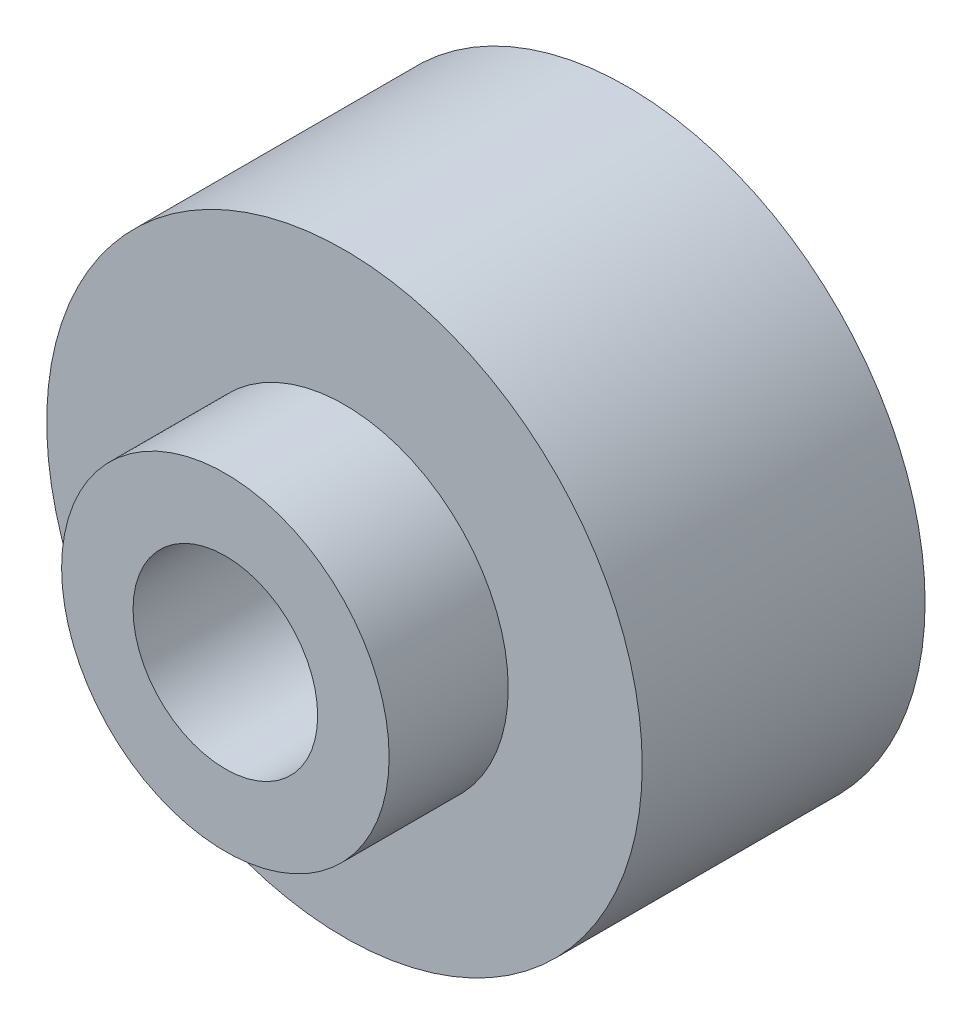
ISO-10303-21;
HEADER;
FILE_DESCRIPTION(('STEP AP214'),'2;1');
FILE_NAME('part.step','',(''),(''),'','','');
FILE_SCHEMA(('AUTOMOTIVE_DESIGN { 1 0 10303 214 1 1 1 1 }'));
ENDSEC;
DATA;
#1=APPLICATION_CONTEXT('core data for automotive mechanical design processes');
#2=APPLICATION_PROTOCOL_DEFINITION('international standard','automotive_design',2000,#1);
#3=PRODUCT_CONTEXT('',#1,'mechanical');
#4=PRODUCT('Part','Part','',(#3));
#5=PRODUCT_RELATED_PRODUCT_CATEGORY('part','',(#4));
#6=PRODUCT_DEFINITION_FORMATION('','',#4);
#7=PRODUCT_DEFINITION_CONTEXT('part definition',#1,'design');
#8=PRODUCT_DEFINITION('design','',#6,#7);
#9=PRODUCT_DEFINITION_SHAPE('','',#8);
#10=(LENGTH_UNIT() NAMED_UNIT(*) SI_UNIT(.MILLI.,.METRE.));
#11=(NAMED_UNIT(*) PLANE_ANGLE_UNIT() SI_UNIT($,.RADIAN.));
#12=(NAMED_UNIT(*) SI_UNIT($,.STERADIAN.) SOLID_ANGLE_UNIT());
#13=UNCERTAINTY_MEASURE_WITH_UNIT(LENGTH_MEASURE(1.E-05),#10,'distance_accuracy_value','');
#14=(GEOMETRIC_REPRESENTATION_CONTEXT(3) GLOBAL_UNCERTAINTY_ASSIGNED_CONTEXT((#13)) GLOBAL_UNIT_ASSIGNED_CONTEXT((#10,
#11,#12)) REPRESENTATION_CONTEXT('',''));
#15=CARTESIAN_POINT('',(0.,0.,0.));
#16=DIRECTION('',(0.,0.,1.));
#17=DIRECTION('',(1.,0.,0.));
#18=AXIS2_PLACEMENT_3D('',#15,#16,#17);
#19=CARTESIAN_POINT('',(0.,0.,4.75));
#20=DIRECTION('',(0.,0.,-1.));
#21=DIRECTION('',(-1.,0.,0.));
#22=AXIS2_PLACEMENT_3D('',#19,#20,#21);
#23=CYLINDRICAL_SURFACE('',#22,1.55);
#24=CARTESIAN_POINT('',(0.,0.,6.75));
#25=DIRECTION('',(0.,0.,1.));
#26=DIRECTION('',(1.,0.,0.));
#27=AXIS2_PLACEMENT_3D('',#24,#25,#26);
#28=CIRCLE('',#27,1.55);
#29=CARTESIAN_POINT('',(1.55,0.,6.75));
#30=VERTEX_POINT('',#29);
#31=EDGE_CURVE('E144',#30,#30,#28,.T.);
#32=ORIENTED_EDGE('',*,*,#31,.T.);
#33=EDGE_LOOP('',(#32));
#34=FACE_BOUND('',#33,.T.);
#35=CARTESIAN_POINT('',(0.,0.,2.75));
#36=DIRECTION('',(0.,0.,-1.));
#37=DIRECTION('',(-1.,0.,0.));
#38=AXIS2_PLACEMENT_3D('',#35,#36,#37);
#39=CIRCLE('',#38,1.55);
#40=CARTESIAN_POINT('',(-1.55,0.,2.75));
#41=VERTEX_POINT('',#40);
#42=EDGE_CURVE('E39',#41,#41,#39,.T.);
#43=ORIENTED_EDGE('',*,*,#42,.T.);
#44=EDGE_LOOP('',(#43));
#45=FACE_BOUND('',#44,.T.);
#46=ADVANCED_FACE('F35',(#34,#45),#23,.F.);
#47=CARTESIAN_POINT('',(0.,0.,4.75));
#48=DIRECTION('',(0.,0.,1.));
#49=DIRECTION('',(1.,0.,0.));
#50=AXIS2_PLACEMENT_3D('',#47,#48,#49);
#51=PLANE('',#50);
#52=CARTESIAN_POINT('',(0.,0.,4.75));
#53=DIRECTION('',(0.,0.,1.));
#54=DIRECTION('',(1.,0.,0.));
#55=AXIS2_PLACEMENT_3D('',#52,#53,#54);
#56=CIRCLE('',#55,5.);
#57=CARTESIAN_POINT('',(5.,0.,4.75));
#58=VERTEX_POINT('',#57);
#59=EDGE_CURVE('E11',#58,#58,#56,.T.);
#60=ORIENTED_EDGE('',*,*,#59,.T.);
#61=EDGE_LOOP('',(#60));
#62=FACE_BOUND('',#61,.T.);
#63=CARTESIAN_POINT('',(0.,0.,4.75));
#64=DIRECTION('',(0.,0.,1.));
#65=DIRECTION('',(1.,0.,0.));
#66=AXIS2_PLACEMENT_3D('',#63,#64,#65);
#67=CIRCLE('',#66,2.75);
#68=CARTESIAN_POINT('',(2.75,0.,4.75));
#69=VERTEX_POINT('',#68);
#70=EDGE_CURVE('E147',#69,#69,#67,.T.);
#71=ORIENTED_EDGE('',*,*,#70,.F.);
#72=EDGE_LOOP('',(#71));
#73=FACE_BOUND('',#72,.T.);
#74=ADVANCED_FACE('F158',(#62,#73),#51,.T.);
#75=CARTESIAN_POINT('',(0.,0.,0.));
#76=DIRECTION('',(0.,0.,1.));
#77=DIRECTION('',(1.,0.,0.));
#78=AXIS2_PLACEMENT_3D('',#75,#76,#77);
#79=PLANE('',#78);
#80=DIRECTION('',(0.99991786627697,0.0128164230622472,0.));
#81=VECTOR('',#80,1.);
#82=CARTESIAN_POINT('',(-1.77035781697432,2.9775549029158,0.));
#83=LINE('',#82,#81);
#84=CARTESIAN_POINT('',(-1.77035781697432,2.9775549029158,0.));
#85=VERTEX_POINT('',#84);
#86=CARTESIAN_POINT('',(1.69345927860083,3.02195229474602,0.));
#87=VERTEX_POINT('',#86);
#88=EDGE_CURVE('E126',#85,#87,#83,.T.);
#89=ORIENTED_EDGE('',*,*,#88,.F.);
#90=DIRECTION('',(0.48885958518093,0.872362485424911,0.));
#91=VECTOR('',#90,1.);
#92=CARTESIAN_POINT('',(-3.46381709557515,-0.0443973918302187,0.));
#93=LINE('',#92,#91);
#94=CARTESIAN_POINT('',(-3.46381709557515,-0.0443973918302187,0.));
#95=VERTEX_POINT('',#94);
#96=EDGE_CURVE('E52',#95,#85,#93,.T.);
#97=ORIENTED_EDGE('',*,*,#96,.F.);
#98=DIRECTION('',(-0.51105828109604,0.859546062362664,0.));
#99=VECTOR('',#98,1.);
#100=CARTESIAN_POINT('',(-1.69345927860083,-3.02195229474602,0.));
#101=LINE('',#100,#99);
#102=CARTESIAN_POINT('',(-1.69345927860083,-3.02195229474602,0.));
#103=VERTEX_POINT('',#102);
#104=EDGE_CURVE('E135',#103,#95,#101,.T.);
#105=ORIENTED_EDGE('',*,*,#104,.F.);
#106=DIRECTION('',(-0.99991786627697,-0.012816423062247,0.));
#107=VECTOR('',#106,1.);
#108=CARTESIAN_POINT('',(1.77035781697432,-2.9775549029158,0.));
#109=LINE('',#108,#107);
#110=CARTESIAN_POINT('',(1.77035781697432,-2.9775549029158,0.));
#111=VERTEX_POINT('',#110);
#112=EDGE_CURVE('E133',#111,#103,#109,.T.);
#113=ORIENTED_EDGE('',*,*,#112,.F.);
#114=DIRECTION('',(-0.488859585180931,-0.872362485424911,0.));
#115=VECTOR('',#114,1.);
#116=CARTESIAN_POINT('',(3.46381709557515,0.0443973918302178,0.));
#117=LINE('',#116,#115);
#118=CARTESIAN_POINT('',(3.46381709557515,0.0443973918302178,0.));
#119=VERTEX_POINT('',#118);
#120=EDGE_CURVE('E100',#119,#111,#117,.T.);
#121=ORIENTED_EDGE('',*,*,#120,.F.);
#122=DIRECTION('',(0.51105828109604,-0.859546062362664,0.));
#123=VECTOR('',#122,1.);
#124=CARTESIAN_POINT('',(1.69345927860083,3.02195229474602,0.));
#125=LINE('',#124,#123);
#126=EDGE_CURVE('E129',#87,#119,#125,.T.);
#127=ORIENTED_EDGE('',*,*,#126,.F.);
#128=EDGE_LOOP('',(#89,#97,#105,#113,#121,#127));
#129=FACE_BOUND('',#128,.T.);
#130=CARTESIAN_POINT('',(0.,0.,0.));
#131=DIRECTION('',(0.,0.,1.));
#132=DIRECTION('',(1.,0.,0.));
#133=AXIS2_PLACEMENT_3D('',#130,#131,#132);
#134=CIRCLE('',#133,5.);
#135=CARTESIAN_POINT('',(5.,0.,0.));
#136=VERTEX_POINT('',#135);
#137=EDGE_CURVE('E44',#136,#136,#134,.T.);
#138=ORIENTED_EDGE('',*,*,#137,.F.);
#139=EDGE_LOOP('',(#138));
#140=FACE_BOUND('',#139,.T.);
#141=ADVANCED_FACE('F156',(#129,#140),#79,.F.);
#142=CARTESIAN_POINT('',(0.,0.,4.75));
#143=DIRECTION('',(0.,0.,-1.));
#144=DIRECTION('',(-1.,0.,0.));
#145=AXIS2_PLACEMENT_3D('',#142,#143,#144);
#146=CYLINDRICAL_SURFACE('',#145,5.);
#147=ORIENTED_EDGE('',*,*,#59,.F.);
#148=EDGE_LOOP('',(#147));
#149=FACE_BOUND('',#148,.T.);
#150=ORIENTED_EDGE('',*,*,#137,.T.);
#151=EDGE_LOOP('',(#150));
#152=FACE_BOUND('',#151,.T.);
#153=ADVANCED_FACE('F37',(#149,#152),#146,.T.);
#154=CARTESIAN_POINT('',(0.,0.,6.75));
#155=DIRECTION('',(0.,0.,1.));
#156=DIRECTION('',(1.,0.,0.));
#157=AXIS2_PLACEMENT_3D('',#154,#155,#156);
#158=PLANE('',#157);
#159=CARTESIAN_POINT('',(0.,0.,6.75));
#160=DIRECTION('',(0.,0.,1.));
#161=DIRECTION('',(1.,0.,0.));
#162=AXIS2_PLACEMENT_3D('',#159,#160,#161);
#163=CIRCLE('',#162,2.75);
#164=CARTESIAN_POINT('',(2.75,0.,6.75));
#165=VERTEX_POINT('',#164);
#166=EDGE_CURVE('E148',#165,#165,#163,.T.);
#167=ORIENTED_EDGE('',*,*,#166,.T.);
#168=EDGE_LOOP('',(#167));
#169=FACE_BOUND('',#168,.T.);
#170=ORIENTED_EDGE('',*,*,#31,.F.);
#171=EDGE_LOOP('',(#170));
#172=FACE_BOUND('',#171,.T.);
#173=ADVANCED_FACE('F164',(#169,#172),#158,.T.);
#174=CARTESIAN_POINT('',(0.,0.,6.75));
#175=DIRECTION('',(0.,0.,-1.));
#176=DIRECTION('',(-1.,0.,0.));
#177=AXIS2_PLACEMENT_3D('',#174,#175,#176);
#178=CYLINDRICAL_SURFACE('',#177,2.75);
#179=ORIENTED_EDGE('',*,*,#166,.F.);
#180=EDGE_LOOP('',(#179));
#181=FACE_BOUND('',#180,.T.);
#182=ORIENTED_EDGE('',*,*,#70,.T.);
#183=EDGE_LOOP('',(#182));
#184=FACE_BOUND('',#183,.T.);
#185=ADVANCED_FACE('F176',(#181,#184),#178,.T.);
#186=CARTESIAN_POINT('',(-3.46381709557515,-0.0443973918302187,2.75));
#187=DIRECTION('',(-0.872362485424911,0.488859585180931,0.));
#188=DIRECTION('',(-0.488859585180931,-0.872362485424911,0.));
#189=AXIS2_PLACEMENT_3D('',#186,#187,#188);
#190=PLANE('',#189);
#191=ORIENTED_EDGE('',*,*,#96,.T.);
#192=DIRECTION('',(0.,0.,-1.));
#193=VECTOR('',#192,1.);
#194=CARTESIAN_POINT('',(-1.77035781697432,2.9775549029158,2.75));
#195=LINE('',#194,#193);
#196=CARTESIAN_POINT('',(-1.77035781697432,2.9775549029158,2.75));
#197=VERTEX_POINT('',#196);
#198=EDGE_CURVE('E82',#197,#85,#195,.T.);
#199=ORIENTED_EDGE('',*,*,#198,.F.);
#200=DIRECTION('',(0.48885958518093,0.872362485424911,0.));
#201=VECTOR('',#200,1.);
#202=CARTESIAN_POINT('',(-3.46381709557515,-0.0443973918302187,2.75));
#203=LINE('',#202,#201);
#204=CARTESIAN_POINT('',(-3.46381709557515,-0.0443973918302187,2.75));
#205=VERTEX_POINT('',#204);
#206=EDGE_CURVE('E137',#205,#197,#203,.T.);
#207=ORIENTED_EDGE('',*,*,#206,.F.);
#208=DIRECTION('',(0.,0.,-1.));
#209=VECTOR('',#208,1.);
#210=CARTESIAN_POINT('',(-3.46381709557515,-0.0443973918302187,2.75));
#211=LINE('',#210,#209);
#212=EDGE_CURVE('E60',#205,#95,#211,.T.);
#213=ORIENTED_EDGE('',*,*,#212,.T.);
#214=EDGE_LOOP('',(#191,#199,#207,#213));
#215=FACE_BOUND('',#214,.T.);
#216=ADVANCED_FACE('F179',(#215),#190,.F.);
#217=CARTESIAN_POINT('',(-1.69345927860083,-3.02195229474602,2.75));
#218=DIRECTION('',(-0.859546062362664,-0.51105828109604,0.));
#219=DIRECTION('',(0.51105828109604,-0.859546062362664,0.));
#220=AXIS2_PLACEMENT_3D('',#217,#218,#219);
#221=PLANE('',#220);
#222=ORIENTED_EDGE('',*,*,#104,.T.);
#223=ORIENTED_EDGE('',*,*,#212,.F.);
#224=DIRECTION('',(-0.51105828109604,0.859546062362664,0.));
#225=VECTOR('',#224,1.);
#226=CARTESIAN_POINT('',(-1.69345927860083,-3.02195229474602,2.75));
#227=LINE('',#226,#225);
#228=CARTESIAN_POINT('',(-1.69345927860083,-3.02195229474602,2.75));
#229=VERTEX_POINT('',#228);
#230=EDGE_CURVE('E112',#229,#205,#227,.T.);
#231=ORIENTED_EDGE('',*,*,#230,.F.);
#232=DIRECTION('',(0.,0.,-1.));
#233=VECTOR('',#232,1.);
#234=CARTESIAN_POINT('',(-1.69345927860083,-3.02195229474602,2.75));
#235=LINE('',#234,#233);
#236=EDGE_CURVE('E104',#229,#103,#235,.T.);
#237=ORIENTED_EDGE('',*,*,#236,.T.);
#238=EDGE_LOOP('',(#222,#223,#231,#237));
#239=FACE_BOUND('',#238,.T.);
#240=ADVANCED_FACE('F186',(#239),#221,.F.);
#241=CARTESIAN_POINT('',(1.77035781697432,-2.9775549029158,2.75));
#242=DIRECTION('',(0.012816423062247,-0.999917866276971,0.));
#243=DIRECTION('',(0.999917866276971,0.012816423062247,0.));
#244=AXIS2_PLACEMENT_3D('',#241,#242,#243);
#245=PLANE('',#244);
#246=ORIENTED_EDGE('',*,*,#112,.T.);
#247=ORIENTED_EDGE('',*,*,#236,.F.);
#248=DIRECTION('',(-0.99991786627697,-0.012816423062247,0.));
#249=VECTOR('',#248,1.);
#250=CARTESIAN_POINT('',(1.77035781697432,-2.9775549029158,2.75));
#251=LINE('',#250,#249);
#252=CARTESIAN_POINT('',(1.77035781697432,-2.9775549029158,2.75));
#253=VERTEX_POINT('',#252);
#254=EDGE_CURVE('E108',#253,#229,#251,.T.);
#255=ORIENTED_EDGE('',*,*,#254,.F.);
#256=DIRECTION('',(0.,0.,-1.));
#257=VECTOR('',#256,1.);
#258=CARTESIAN_POINT('',(1.77035781697432,-2.9775549029158,2.75));
#259=LINE('',#258,#257);
#260=EDGE_CURVE('E93',#253,#111,#259,.T.);
#261=ORIENTED_EDGE('',*,*,#260,.T.);
#262=EDGE_LOOP('',(#246,#247,#255,#261));
#263=FACE_BOUND('',#262,.T.);
#264=ADVANCED_FACE('F109',(#263),#245,.F.);
#265=CARTESIAN_POINT('',(3.46381709557515,0.0443973918302178,2.75));
#266=DIRECTION('',(0.872362485424911,-0.488859585180931,0.));
#267=DIRECTION('',(0.488859585180931,0.872362485424911,0.));
#268=AXIS2_PLACEMENT_3D('',#265,#266,#267);
#269=PLANE('',#268);
#270=ORIENTED_EDGE('',*,*,#120,.T.);
#271=ORIENTED_EDGE('',*,*,#260,.F.);
#272=DIRECTION('',(-0.488859585180931,-0.872362485424911,0.));
#273=VECTOR('',#272,1.);
#274=CARTESIAN_POINT('',(3.46381709557515,0.0443973918302178,2.75));
#275=LINE('',#274,#273);
#276=CARTESIAN_POINT('',(3.46381709557515,0.0443973918302178,2.75));
#277=VERTEX_POINT('',#276);
#278=EDGE_CURVE('E97',#277,#253,#275,.T.);
#279=ORIENTED_EDGE('',*,*,#278,.F.);
#280=DIRECTION('',(0.,0.,-1.));
#281=VECTOR('',#280,1.);
#282=CARTESIAN_POINT('',(3.46381709557515,0.0443973918302178,2.75));
#283=LINE('',#282,#281);
#284=EDGE_CURVE('E105',#277,#119,#283,.T.);
#285=ORIENTED_EDGE('',*,*,#284,.T.);
#286=EDGE_LOOP('',(#270,#271,#279,#285));
#287=FACE_BOUND('',#286,.T.);
#288=ADVANCED_FACE('F95',(#287),#269,.F.);
#289=CARTESIAN_POINT('',(1.69345927860083,3.02195229474602,2.75));
#290=DIRECTION('',(0.859546062362664,0.51105828109604,0.));
#291=DIRECTION('',(-0.51105828109604,0.859546062362664,0.));
#292=AXIS2_PLACEMENT_3D('',#289,#290,#291);
#293=PLANE('',#292);
#294=ORIENTED_EDGE('',*,*,#126,.T.);
#295=ORIENTED_EDGE('',*,*,#284,.F.);
#296=DIRECTION('',(0.51105828109604,-0.859546062362664,0.));
#297=VECTOR('',#296,1.);
#298=CARTESIAN_POINT('',(1.69345927860083,3.02195229474602,2.75));
#299=LINE('',#298,#297);
#300=CARTESIAN_POINT('',(1.69345927860083,3.02195229474602,2.75));
#301=VERTEX_POINT('',#300);
#302=EDGE_CURVE('E118',#301,#277,#299,.T.);
#303=ORIENTED_EDGE('',*,*,#302,.F.);
#304=DIRECTION('',(0.,0.,-1.));
#305=VECTOR('',#304,1.);
#306=CARTESIAN_POINT('',(1.69345927860083,3.02195229474602,2.75));
#307=LINE('',#306,#305);
#308=EDGE_CURVE('E141',#301,#87,#307,.T.);
#309=ORIENTED_EDGE('',*,*,#308,.T.);
#310=EDGE_LOOP('',(#294,#295,#303,#309));
#311=FACE_BOUND('',#310,.T.);
#312=ADVANCED_FACE('F190',(#311),#293,.F.);
#313=CARTESIAN_POINT('',(-1.77035781697432,2.9775549029158,2.75));
#314=DIRECTION('',(-0.0128164230622472,0.999917866276971,0.));
#315=DIRECTION('',(-0.999917866276971,-0.0128164230622472,0.));
#316=AXIS2_PLACEMENT_3D('',#313,#314,#315);
#317=PLANE('',#316);
#318=ORIENTED_EDGE('',*,*,#88,.T.);
#319=ORIENTED_EDGE('',*,*,#308,.F.);
#320=DIRECTION('',(0.99991786627697,0.0128164230622472,0.));
#321=VECTOR('',#320,1.);
#322=CARTESIAN_POINT('',(-1.77035781697432,2.9775549029158,2.75));
#323=LINE('',#322,#321);
#324=EDGE_CURVE('E120',#197,#301,#323,.T.);
#325=ORIENTED_EDGE('',*,*,#324,.F.);
#326=ORIENTED_EDGE('',*,*,#198,.T.);
#327=EDGE_LOOP('',(#318,#319,#325,#326));
#328=FACE_BOUND('',#327,.T.);
#329=ADVANCED_FACE('F187',(#328),#317,.F.);
#330=CARTESIAN_POINT('',(0.,0.,2.75));
#331=DIRECTION('',(0.,0.,-1.));
#332=DIRECTION('',(-1.,0.,0.));
#333=AXIS2_PLACEMENT_3D('',#330,#331,#332);
#334=PLANE('',#333);
#335=ORIENTED_EDGE('',*,*,#42,.F.);
#336=EDGE_LOOP('',(#335));
#337=FACE_BOUND('',#336,.T.);
#338=ORIENTED_EDGE('',*,*,#206,.T.);
#339=ORIENTED_EDGE('',*,*,#324,.T.);
#340=ORIENTED_EDGE('',*,*,#302,.T.);
#341=ORIENTED_EDGE('',*,*,#278,.T.);
#342=ORIENTED_EDGE('',*,*,#254,.T.);
#343=ORIENTED_EDGE('',*,*,#230,.T.);
#344=EDGE_LOOP('',(#338,#339,#340,#341,#342,#343));
#345=FACE_BOUND('',#344,.T.);
#346=ADVANCED_FACE('F115',(#337,#345),#334,.T.);
#347=CLOSED_SHELL('',(#46,#74,#141,#153,#173,#185,#216,#240,#264,#288,#312,#329,#346));
#348=MANIFOLD_SOLID_BREP('B2',#347);
#349=ADVANCED_BREP_SHAPE_REPRESENTATION('',(#18,#348),#14);
#350=SHAPE_DEFINITION_REPRESENTATION(#9,#349);
ENDSEC;
END-ISO-10303-21;
